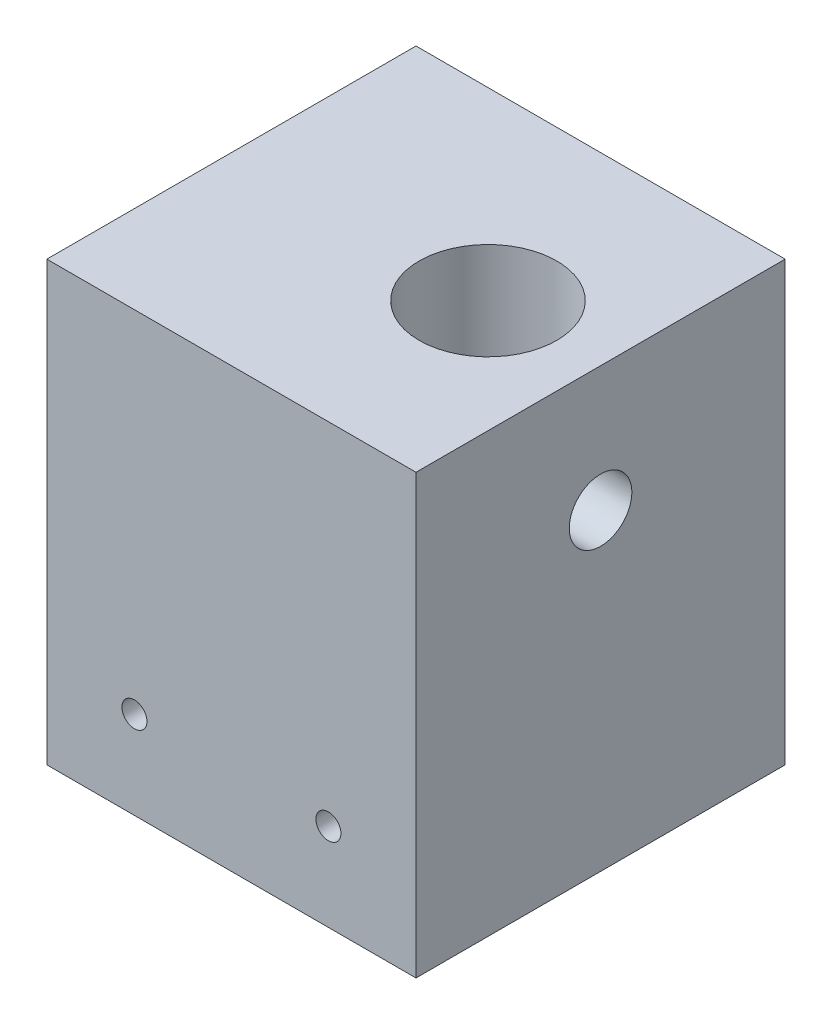
ISO-10303-21;
HEADER;
FILE_DESCRIPTION(('STEP AP214'),'2;1');
FILE_NAME('part.step','',(''),(''),'','','');
FILE_SCHEMA(('AUTOMOTIVE_DESIGN { 1 0 10303 214 1 1 1 1 }'));
ENDSEC;
DATA;
#1=APPLICATION_CONTEXT('core data for automotive mechanical design processes');
#2=APPLICATION_PROTOCOL_DEFINITION('international standard','automotive_design',2000,#1);
#3=PRODUCT_CONTEXT('',#1,'mechanical');
#4=PRODUCT('Part','Part','',(#3));
#5=PRODUCT_RELATED_PRODUCT_CATEGORY('part','',(#4));
#6=PRODUCT_DEFINITION_FORMATION('','',#4);
#7=PRODUCT_DEFINITION_CONTEXT('part definition',#1,'design');
#8=PRODUCT_DEFINITION('design','',#6,#7);
#9=PRODUCT_DEFINITION_SHAPE('','',#8);
#10=(LENGTH_UNIT() NAMED_UNIT(*) SI_UNIT(.MILLI.,.METRE.));
#11=(NAMED_UNIT(*) PLANE_ANGLE_UNIT() SI_UNIT($,.RADIAN.));
#12=(NAMED_UNIT(*) SI_UNIT($,.STERADIAN.) SOLID_ANGLE_UNIT());
#13=UNCERTAINTY_MEASURE_WITH_UNIT(LENGTH_MEASURE(1.E-05),#10,'distance_accuracy_value','');
#14=(GEOMETRIC_REPRESENTATION_CONTEXT(3) GLOBAL_UNCERTAINTY_ASSIGNED_CONTEXT((#13)) GLOBAL_UNIT_ASSIGNED_CONTEXT((#10,
#11,#12)) REPRESENTATION_CONTEXT('',''));
#15=CARTESIAN_POINT('',(0.,0.,0.));
#16=DIRECTION('',(0.,0.,1.));
#17=DIRECTION('',(1.,0.,0.));
#18=AXIS2_PLACEMENT_3D('',#15,#16,#17);
#19=CARTESIAN_POINT('',(-29.2910308500217,70.,-17.4414774606947));
#20=DIRECTION('',(1.,0.,0.));
#21=DIRECTION('',(0.,0.,-1.));
#22=AXIS2_PLACEMENT_3D('',#19,#20,#21);
#23=PLANE('',#22);
#24=DIRECTION('',(0.,0.,1.));
#25=VECTOR('',#24,1.);
#26=CARTESIAN_POINT('',(-29.2910308500217,0.,-17.4414774606947));
#27=LINE('',#26,#25);
#28=CARTESIAN_POINT('',(-29.2910308500217,0.,-17.4414774606947));
#29=VERTEX_POINT('',#28);
#30=CARTESIAN_POINT('',(-29.2910308500217,0.,41.5585225393053));
#31=VERTEX_POINT('',#30);
#32=EDGE_CURVE('E101',#29,#31,#27,.T.);
#33=ORIENTED_EDGE('',*,*,#32,.T.);
#34=DIRECTION('',(0.,-1.,0.));
#35=VECTOR('',#34,1.);
#36=CARTESIAN_POINT('',(-29.2910308500217,70.,41.5585225393053));
#37=LINE('',#36,#35);
#38=CARTESIAN_POINT('',(-29.2910308500217,70.,41.5585225393053));
#39=VERTEX_POINT('',#38);
#40=EDGE_CURVE('E11',#39,#31,#37,.T.);
#41=ORIENTED_EDGE('',*,*,#40,.F.);
#42=DIRECTION('',(0.,0.,1.));
#43=VECTOR('',#42,1.);
#44=CARTESIAN_POINT('',(-29.2910308500217,70.,-17.4414774606947));
#45=LINE('',#44,#43);
#46=CARTESIAN_POINT('',(-29.2910308500217,70.,-17.4414774606947));
#47=VERTEX_POINT('',#46);
#48=EDGE_CURVE('E86',#47,#39,#45,.T.);
#49=ORIENTED_EDGE('',*,*,#48,.F.);
#50=DIRECTION('',(0.,-1.,0.));
#51=VECTOR('',#50,1.);
#52=CARTESIAN_POINT('',(-29.2910308500217,70.,-17.4414774606947));
#53=LINE('',#52,#51);
#54=EDGE_CURVE('E97',#47,#29,#53,.T.);
#55=ORIENTED_EDGE('',*,*,#54,.T.);
#56=EDGE_LOOP('',(#33,#41,#49,#55));
#57=FACE_BOUND('',#56,.T.);
#58=ADVANCED_FACE('F33',(#57),#23,.F.);
#59=CARTESIAN_POINT('',(-29.2910308500217,70.,41.5585225393053));
#60=DIRECTION('',(0.,0.,-1.));
#61=DIRECTION('',(-1.,0.,0.));
#62=AXIS2_PLACEMENT_3D('',#59,#60,#61);
#63=PLANE('',#62);
#64=CARTESIAN_POINT('',(15.7089691499783,14.,41.5585225393053));
#65=DIRECTION('',(0.,0.,1.));
#66=DIRECTION('',(1.,0.,0.));
#67=AXIS2_PLACEMENT_3D('',#64,#65,#66);
#68=CIRCLE('',#67,2.);
#69=CARTESIAN_POINT('',(17.7089691499783,14.,41.5585225393053));
#70=VERTEX_POINT('',#69);
#71=EDGE_CURVE('E124',#70,#70,#68,.T.);
#72=ORIENTED_EDGE('',*,*,#71,.F.);
#73=EDGE_LOOP('',(#72));
#74=FACE_BOUND('',#73,.T.);
#75=CARTESIAN_POINT('',(-15.2910308500216,14.,41.5585225393053));
#76=DIRECTION('',(0.,0.,1.));
#77=DIRECTION('',(1.,0.,0.));
#78=AXIS2_PLACEMENT_3D('',#75,#76,#77);
#79=CIRCLE('',#78,2.);
#80=CARTESIAN_POINT('',(-13.2910308500216,14.,41.5585225393053));
#81=VERTEX_POINT('',#80);
#82=EDGE_CURVE('E118',#81,#81,#79,.T.);
#83=ORIENTED_EDGE('',*,*,#82,.F.);
#84=EDGE_LOOP('',(#83));
#85=FACE_BOUND('',#84,.T.);
#86=DIRECTION('',(1.,0.,0.));
#87=VECTOR('',#86,1.);
#88=CARTESIAN_POINT('',(-29.2910308500217,0.,41.5585225393053));
#89=LINE('',#88,#87);
#90=CARTESIAN_POINT('',(29.7089691499783,0.,41.5585225393053));
#91=VERTEX_POINT('',#90);
#92=EDGE_CURVE('E91',#31,#91,#89,.T.);
#93=ORIENTED_EDGE('',*,*,#92,.T.);
#94=DIRECTION('',(0.,-1.,0.));
#95=VECTOR('',#94,1.);
#96=CARTESIAN_POINT('',(29.7089691499783,70.,41.5585225393053));
#97=LINE('',#96,#95);
#98=CARTESIAN_POINT('',(29.7089691499783,70.,41.5585225393053));
#99=VERTEX_POINT('',#98);
#100=EDGE_CURVE('E40',#99,#91,#97,.T.);
#101=ORIENTED_EDGE('',*,*,#100,.F.);
#102=DIRECTION('',(1.,0.,0.));
#103=VECTOR('',#102,1.);
#104=CARTESIAN_POINT('',(-29.2910308500217,70.,41.5585225393053));
#105=LINE('',#104,#103);
#106=EDGE_CURVE('E80',#39,#99,#105,.T.);
#107=ORIENTED_EDGE('',*,*,#106,.F.);
#108=ORIENTED_EDGE('',*,*,#40,.T.);
#109=EDGE_LOOP('',(#93,#101,#107,#108));
#110=FACE_BOUND('',#109,.T.);
#111=ADVANCED_FACE('F90',(#74,#85,#110),#63,.F.);
#112=CARTESIAN_POINT('',(29.7089691499783,70.,-17.4414774606947));
#113=DIRECTION('',(-1.,0.,0.));
#114=DIRECTION('',(0.,0.,1.));
#115=AXIS2_PLACEMENT_3D('',#112,#113,#114);
#116=PLANE('',#115);
#117=CARTESIAN_POINT('',(29.7089691499783,50.,12.0585225393053));
#118=DIRECTION('',(1.,0.,0.));
#119=DIRECTION('',(0.,0.,-1.));
#120=AXIS2_PLACEMENT_3D('',#117,#118,#119);
#121=CIRCLE('',#120,5.);
#122=CARTESIAN_POINT('',(29.7089691499783,50.,7.05852253930527));
#123=VERTEX_POINT('',#122);
#124=EDGE_CURVE('E131',#123,#123,#121,.T.);
#125=ORIENTED_EDGE('',*,*,#124,.F.);
#126=EDGE_LOOP('',(#125));
#127=FACE_BOUND('',#126,.T.);
#128=DIRECTION('',(0.,0.,-1.));
#129=VECTOR('',#128,1.);
#130=CARTESIAN_POINT('',(29.7089691499783,0.,-17.4414774606947));
#131=LINE('',#130,#129);
#132=CARTESIAN_POINT('',(29.7089691499783,0.,-17.4414774606947));
#133=VERTEX_POINT('',#132);
#134=EDGE_CURVE('E106',#91,#133,#131,.T.);
#135=ORIENTED_EDGE('',*,*,#134,.T.);
#136=DIRECTION('',(0.,-1.,0.));
#137=VECTOR('',#136,1.);
#138=CARTESIAN_POINT('',(29.7089691499783,70.,-17.4414774606947));
#139=LINE('',#138,#137);
#140=CARTESIAN_POINT('',(29.7089691499783,70.,-17.4414774606947));
#141=VERTEX_POINT('',#140);
#142=EDGE_CURVE('E94',#141,#133,#139,.T.);
#143=ORIENTED_EDGE('',*,*,#142,.F.);
#144=DIRECTION('',(0.,0.,-1.));
#145=VECTOR('',#144,1.);
#146=CARTESIAN_POINT('',(29.7089691499783,70.,-17.4414774606947));
#147=LINE('',#146,#145);
#148=EDGE_CURVE('E83',#99,#141,#147,.T.);
#149=ORIENTED_EDGE('',*,*,#148,.F.);
#150=ORIENTED_EDGE('',*,*,#100,.T.);
#151=EDGE_LOOP('',(#135,#143,#149,#150));
#152=FACE_BOUND('',#151,.T.);
#153=ADVANCED_FACE('F95',(#127,#152),#116,.F.);
#154=CARTESIAN_POINT('',(-29.2910308500217,70.,-17.4414774606947));
#155=DIRECTION('',(0.,0.,1.));
#156=DIRECTION('',(1.,0.,0.));
#157=AXIS2_PLACEMENT_3D('',#154,#155,#156);
#158=PLANE('',#157);
#159=CARTESIAN_POINT('',(15.7089691499783,14.,-17.4414774606947));
#160=DIRECTION('',(0.,0.,1.));
#161=DIRECTION('',(1.,0.,0.));
#162=AXIS2_PLACEMENT_3D('',#159,#160,#161);
#163=CIRCLE('',#162,2.);
#164=CARTESIAN_POINT('',(17.7089691499783,14.,-17.4414774606947));
#165=VERTEX_POINT('',#164);
#166=EDGE_CURVE('E121',#165,#165,#163,.F.);
#167=ORIENTED_EDGE('',*,*,#166,.F.);
#168=EDGE_LOOP('',(#167));
#169=FACE_BOUND('',#168,.T.);
#170=CARTESIAN_POINT('',(-15.2910308500216,14.,-17.4414774606947));
#171=DIRECTION('',(0.,0.,1.));
#172=DIRECTION('',(1.,0.,0.));
#173=AXIS2_PLACEMENT_3D('',#170,#171,#172);
#174=CIRCLE('',#173,2.);
#175=CARTESIAN_POINT('',(-13.2910308500216,14.,-17.4414774606947));
#176=VERTEX_POINT('',#175);
#177=EDGE_CURVE('E104',#176,#176,#174,.F.);
#178=ORIENTED_EDGE('',*,*,#177,.F.);
#179=EDGE_LOOP('',(#178));
#180=FACE_BOUND('',#179,.T.);
#181=DIRECTION('',(-1.,0.,0.));
#182=VECTOR('',#181,1.);
#183=CARTESIAN_POINT('',(-29.2910308500217,0.,-17.4414774606947));
#184=LINE('',#183,#182);
#185=EDGE_CURVE('E73',#133,#29,#184,.T.);
#186=ORIENTED_EDGE('',*,*,#185,.T.);
#187=ORIENTED_EDGE('',*,*,#54,.F.);
#188=DIRECTION('',(-1.,0.,0.));
#189=VECTOR('',#188,1.);
#190=CARTESIAN_POINT('',(-29.2910308500217,70.,-17.4414774606947));
#191=LINE('',#190,#189);
#192=EDGE_CURVE('E53',#141,#47,#191,.T.);
#193=ORIENTED_EDGE('',*,*,#192,.F.);
#194=ORIENTED_EDGE('',*,*,#142,.T.);
#195=EDGE_LOOP('',(#186,#187,#193,#194));
#196=FACE_BOUND('',#195,.T.);
#197=ADVANCED_FACE('F110',(#169,#180,#196),#158,.F.);
#198=CARTESIAN_POINT('',(0.,70.,0.));
#199=DIRECTION('',(0.,1.,0.));
#200=DIRECTION('',(0.,0.,1.));
#201=AXIS2_PLACEMENT_3D('',#198,#199,#200);
#202=PLANE('',#201);
#203=CARTESIAN_POINT('',(11.7089691499783,70.,12.0585225393053));
#204=DIRECTION('',(0.,1.,0.));
#205=DIRECTION('',(0.,0.,1.));
#206=AXIS2_PLACEMENT_3D('',#203,#204,#205);
#207=CIRCLE('',#206,11.);
#208=CARTESIAN_POINT('',(11.7089691499783,70.,23.0585225393053));
#209=VERTEX_POINT('',#208);
#210=EDGE_CURVE('E128',#209,#209,#207,.T.);
#211=ORIENTED_EDGE('',*,*,#210,.F.);
#212=EDGE_LOOP('',(#211));
#213=FACE_BOUND('',#212,.T.);
#214=ORIENTED_EDGE('',*,*,#48,.T.);
#215=ORIENTED_EDGE('',*,*,#106,.T.);
#216=ORIENTED_EDGE('',*,*,#148,.T.);
#217=ORIENTED_EDGE('',*,*,#192,.T.);
#218=EDGE_LOOP('',(#214,#215,#216,#217));
#219=FACE_BOUND('',#218,.T.);
#220=ADVANCED_FACE('F81',(#213,#219),#202,.T.);
#221=CARTESIAN_POINT('',(0.,0.,0.));
#222=DIRECTION('',(0.,1.,0.));
#223=DIRECTION('',(0.,0.,1.));
#224=AXIS2_PLACEMENT_3D('',#221,#222,#223);
#225=PLANE('',#224);
#226=ORIENTED_EDGE('',*,*,#32,.F.);
#227=ORIENTED_EDGE('',*,*,#185,.F.);
#228=ORIENTED_EDGE('',*,*,#134,.F.);
#229=ORIENTED_EDGE('',*,*,#92,.F.);
#230=EDGE_LOOP('',(#226,#227,#228,#229));
#231=FACE_BOUND('',#230,.T.);
#232=ADVANCED_FACE('F113',(#231),#225,.F.);
#233=CARTESIAN_POINT('',(-15.2910308500216,14.,-17.4424774606947));
#234=DIRECTION('',(0.,0.,1.));
#235=DIRECTION('',(1.,0.,0.));
#236=AXIS2_PLACEMENT_3D('',#233,#234,#235);
#237=CYLINDRICAL_SURFACE('',#236,2.);
#238=ORIENTED_EDGE('',*,*,#82,.T.);
#239=EDGE_LOOP('',(#238));
#240=FACE_BOUND('',#239,.T.);
#241=ORIENTED_EDGE('',*,*,#177,.T.);
#242=EDGE_LOOP('',(#241));
#243=FACE_BOUND('',#242,.T.);
#244=ADVANCED_FACE('F157',(#240,#243),#237,.F.);
#245=CARTESIAN_POINT('',(15.7089691499783,14.,-17.4424774606947));
#246=DIRECTION('',(0.,0.,1.));
#247=DIRECTION('',(1.,0.,0.));
#248=AXIS2_PLACEMENT_3D('',#245,#246,#247);
#249=CYLINDRICAL_SURFACE('',#248,2.);
#250=ORIENTED_EDGE('',*,*,#71,.T.);
#251=EDGE_LOOP('',(#250));
#252=FACE_BOUND('',#251,.T.);
#253=ORIENTED_EDGE('',*,*,#166,.T.);
#254=EDGE_LOOP('',(#253));
#255=FACE_BOUND('',#254,.T.);
#256=ADVANCED_FACE('F153',(#252,#255),#249,.F.);
#257=CARTESIAN_POINT('',(11.7089691499783,45.,12.0585225393053));
#258=DIRECTION('',(0.,1.,0.));
#259=DIRECTION('',(0.,0.,1.));
#260=AXIS2_PLACEMENT_3D('',#257,#258,#259);
#261=CYLINDRICAL_SURFACE('',#260,11.);
#262=CARTESIAN_POINT('',(11.7089691499783,45.,12.0585225393053));
#263=DIRECTION('',(0.,1.,0.));
#264=DIRECTION('',(0.,0.,1.));
#265=AXIS2_PLACEMENT_3D('',#262,#263,#264);
#266=CIRCLE('',#265,11.);
#267=CARTESIAN_POINT('',(22.7089691499783,45.,12.0585225393053));
#268=VERTEX_POINT('',#267);
#269=EDGE_CURVE('E127',#268,#268,#266,.T.);
#270=ORIENTED_EDGE('',*,*,#269,.F.);
#271=CARTESIAN_POINT('',(21.5069281211111,50.,7.05852253930527));
#272=CARTESIAN_POINT('',(21.5069293280527,49.8679173210699,7.05852358534839));
#273=CARTESIAN_POINT('',(21.5096082249125,49.7358026679107,7.06376370524182));
#274=CARTESIAN_POINT('',(21.5202318962564,49.4725578587148,7.08466527289141));
#275=CARTESIAN_POINT('',(21.528179688191,49.341428310384,7.10033269229194));
#276=CARTESIAN_POINT('',(21.5490787390548,49.080957058461,7.1419398760196));
#277=CARTESIAN_POINT('',(21.5620394912622,48.9516192322237,7.16789913283113));
#278=CARTESIAN_POINT('',(21.5925238577832,48.6958569461342,7.22980277477237));
#279=CARTESIAN_POINT('',(21.6100494161234,48.5694337525744,7.26575141454511));
#280=CARTESIAN_POINT('',(21.6489938669881,48.3209927471774,7.34705497100975));
#281=CARTESIAN_POINT('',(21.6703925587851,48.1989558412882,7.3923612473474));
#282=CARTESIAN_POINT('',(21.7164981889132,47.9592917103172,7.49208191514752));
#283=CARTESIAN_POINT('',(21.741206379139,47.8416661755969,7.54649975522787));
#284=CARTESIAN_POINT('',(21.8192362379378,47.4964750042423,7.72274128849976));
#285=CARTESIAN_POINT('',(21.8765093001181,47.2763169195181,7.85764478994638));
#286=CARTESIAN_POINT('',(21.999798282919,46.8461772171732,8.16895880598199));
#287=CARTESIAN_POINT('',(22.0661434511006,46.6378877844904,8.34755766083746));
#288=CARTESIAN_POINT('',(22.1974618835479,46.2528341842249,8.73683743589441));
#289=CARTESIAN_POINT('',(22.2624345463262,46.0760835955238,8.94753210275637));
#290=CARTESIAN_POINT('',(22.3556140891339,45.8338288574682,9.2901201210345));
#291=CARTESIAN_POINT('',(22.3866823782892,45.7552324689297,9.41218441184158));
#292=CARTESIAN_POINT('',(22.4457809475878,45.6086872812711,9.66322224823257));
#293=CARTESIAN_POINT('',(22.4738125090081,45.5407339861068,9.792192845267));
#294=CARTESIAN_POINT('',(22.5260351867077,45.4161021230378,10.0562240169791));
#295=CARTESIAN_POINT('',(22.5502261148675,45.3594241073775,10.1912848895512));
#296=CARTESIAN_POINT('',(22.5940376541186,45.257973994221,10.4664565554701));
#297=CARTESIAN_POINT('',(22.6136606679392,45.2131956357253,10.6065646489807));
#298=CARTESIAN_POINT('',(22.6467208168966,45.1383677661874,10.8822206861574));
#299=CARTESIAN_POINT('',(22.6604589521726,45.1075945291213,11.0175362783581));
#300=CARTESIAN_POINT('',(22.682986259509,45.0573735271231,11.2906012093711));
#301=CARTESIAN_POINT('',(22.6917777278464,45.037920507124,11.4283493882802));
#302=CARTESIAN_POINT('',(22.7041659966365,45.0105608934896,11.7051929867573));
#303=CARTESIAN_POINT('',(22.70776383737,45.002651987571,11.8442881309083));
#304=CARTESIAN_POINT('',(22.7096626109521,44.9984741363374,12.1226862635707));
#305=CARTESIAN_POINT('',(22.7079637977118,45.0022046330527,12.2619892417991));
#306=CARTESIAN_POINT('',(22.6996343189569,45.0205643031978,12.5295641266342));
#307=CARTESIAN_POINT('',(22.6933699402222,45.0343841601721,12.6579039319014));
#308=CARTESIAN_POINT('',(22.6764842165653,45.0718496314977,12.9128915440009));
#309=CARTESIAN_POINT('',(22.6658614471496,45.0954984583756,13.0395387836487));
#310=CARTESIAN_POINT('',(22.6405206421017,45.152375029347,13.2902034038339));
#311=CARTESIAN_POINT('',(22.6258039752329,45.1855995720065,13.4142216484668));
#312=CARTESIAN_POINT('',(22.5926297124611,45.261306733177,13.6589020619532));
#313=CARTESIAN_POINT('',(22.5741706892561,45.303792884451,13.779562930305));
#314=CARTESIAN_POINT('',(22.5132015016936,45.4459986464636,14.1388959778144));
#315=CARTESIAN_POINT('',(22.4654765454577,45.5596499767068,14.3713471622879));
#316=CARTESIAN_POINT('',(22.3606059238175,45.8201042765048,14.8143627674766));
#317=CARTESIAN_POINT('',(22.3034568099564,45.9669193885417,15.0249191303522));
#318=CARTESIAN_POINT('',(22.1798093954521,46.3033849638686,15.4365911009568));
#319=CARTESIAN_POINT('',(22.1129287336833,46.4955519799619,15.6355372037354));
#320=CARTESIAN_POINT('',(21.9805991341564,46.9105111236905,15.9994860710281));
#321=CARTESIAN_POINT('',(21.9151509906035,47.1333197646374,16.1644704124301));
#322=CARTESIAN_POINT('',(21.8220923937575,47.4921216524752,16.3865235253923));
#323=CARTESIAN_POINT('',(21.7913190936561,47.6188591439386,16.4575406021443));
#324=CARTESIAN_POINT('',(21.7331480881747,47.8786411399072,16.5885299735649));
#325=CARTESIAN_POINT('',(21.7057489774715,48.0116829865088,16.6485068715642));
#326=CARTESIAN_POINT('',(21.6553141467485,48.2831547011219,16.756798121509));
#327=CARTESIAN_POINT('',(21.6322763317767,48.4215819435346,16.8051180759522));
#328=CARTESIAN_POINT('',(21.5914396006044,48.7028611321448,16.8895661886511));
#329=CARTESIAN_POINT('',(21.5736401084945,48.8457125900271,16.9256956872086));
#330=CARTESIAN_POINT('',(21.545093791552,49.1241505787865,16.9831142304419));
#331=CARTESIAN_POINT('',(21.5339287717928,49.2595116434057,17.0052902366724));
#332=CARTESIAN_POINT('',(21.5171601022788,49.5319349031965,17.0384561344657));
#333=CARTESIAN_POINT('',(21.5115559604694,49.6689969467701,17.0494470157471));
#334=CARTESIAN_POINT('',(21.5061288682566,49.9436221102819,17.0600920462336));
#335=CARTESIAN_POINT('',(21.5063036801157,50.081185015644,17.0597505835705));
#336=CARTESIAN_POINT('',(21.5124216369931,50.3556807359476,17.0477473533969));
#337=CARTESIAN_POINT('',(21.5183645309616,50.4926135780513,17.0360860785696));
#338=CARTESIAN_POINT('',(21.5350647799976,50.7534335361661,17.0030301484236));
#339=CARTESIAN_POINT('',(21.5453827192696,50.8774619906973,16.9825214350216));
#340=CARTESIAN_POINT('',(21.5703405126454,51.1232207035374,16.9323432362687));
#341=CARTESIAN_POINT('',(21.5849817319668,51.2449502229433,16.9026708570535));
#342=CARTESIAN_POINT('',(21.634751877344,51.6054971593774,16.8003235721328));
#343=CARTESIAN_POINT('',(21.6757402801146,51.839859791701,16.7142943880432));
#344=CARTESIAN_POINT('',(21.7709456196197,52.3014987360579,16.5049090756067));
#345=CARTESIAN_POINT('',(21.8256785760124,52.5279704854606,16.3800358478335));
#346=CARTESIAN_POINT('',(21.9416026090885,52.9579894020815,16.0978850291328));
#347=CARTESIAN_POINT('',(22.0027967914891,53.1615254467339,15.9405918199923));
#348=CARTESIAN_POINT('',(22.1321313729451,53.5611232228233,15.5796054860876));
#349=CARTESIAN_POINT('',(22.2003530730513,53.7543896344801,15.3728414317373));
#350=CARTESIAN_POINT('',(22.3305594060097,54.1042157566132,14.9282412646211));
#351=CARTESIAN_POINT('',(22.3925429721193,54.2607691951112,14.6903998534472));
#352=CARTESIAN_POINT('',(22.4761715632307,54.465033262432,14.3133635579673));
#353=CARTESIAN_POINT('',(22.502621973497,54.5283171404165,14.1834506591068));
#354=CARTESIAN_POINT('',(22.5514998532177,54.6436203644133,13.9180093622417));
#355=CARTESIAN_POINT('',(22.5739290667362,54.6956445959714,13.7824834302584));
#356=CARTESIAN_POINT('',(22.6140948547672,54.7878477952021,13.5068434882259));
#357=CARTESIAN_POINT('',(22.6318331343504,54.8280310674604,13.3667311661152));
#358=CARTESIAN_POINT('',(22.6620872154888,54.8960930908442,13.0829967789546));
#359=CARTESIAN_POINT('',(22.6746035049602,54.9239729915484,12.9393750431345));
#360=CARTESIAN_POINT('',(22.6932404988476,54.9653325109347,12.6615076586751));
#361=CARTESIAN_POINT('',(22.6997941954625,54.9797890008153,12.5274356110763));
#362=CARTESIAN_POINT('',(22.7079758418999,54.9978209253767,12.2584144922636));
#363=CARTESIAN_POINT('',(22.7096040682276,55.0013969708622,12.1234654707074));
#364=CARTESIAN_POINT('',(22.7078900566199,54.9976258060142,11.8537815102018));
#365=CARTESIAN_POINT('',(22.7045488655801,54.990280896373,11.7190465321459));
#366=CARTESIAN_POINT('',(22.6929903413852,54.9647608429357,11.4508217052268));
#367=CARTESIAN_POINT('',(22.684773076179,54.9465858500586,11.317331839039));
#368=CARTESIAN_POINT('',(22.6641918007119,54.9007451424797,11.0589907676515));
#369=CARTESIAN_POINT('',(22.6520467187293,54.8735790246001,10.9340332775817));
#370=CARTESIAN_POINT('',(22.62383624462,54.8098989095211,10.6869639019392));
#371=CARTESIAN_POINT('',(22.6077695832865,54.7733818857422,10.5648529516853));
#372=CARTESIAN_POINT('',(22.554229505632,54.6502918585214,10.2040013534889));
#373=CARTESIAN_POINT('',(22.5113981658849,54.5501417107286,9.97052968190506));
#374=CARTESIAN_POINT('',(22.4130600467329,54.3115973706824,9.51297200125048));
#375=CARTESIAN_POINT('',(22.3570631756473,54.1716636686301,9.28980349176803));
#376=CARTESIAN_POINT('',(22.2387054437516,53.8595564758061,8.86909565082526));
#377=CARTESIAN_POINT('',(22.1763418070851,53.6873688950663,8.67156758437027));
#378=CARTESIAN_POINT('',(22.045675212644,53.2990398538788,8.29071909998991));
#379=CARTESIAN_POINT('',(21.9773074979166,53.0804413954771,8.10992355515062));
#380=CARTESIAN_POINT('',(21.8471992661557,52.6141205873621,7.78690475915852));
#381=CARTESIAN_POINT('',(21.7854631335516,52.3663791939624,7.64470693295209));
#382=CARTESIAN_POINT('',(21.7034807874254,51.9765310205315,7.46350648377464));
#383=CARTESIAN_POINT('',(21.6778312059475,51.8428894607224,7.40827813393262));
#384=CARTESIAN_POINT('',(21.6311138114228,51.570634856846,7.30941314939233));
#385=CARTESIAN_POINT('',(21.6100436881644,51.432024360778,7.26577066746765));
#386=CARTESIAN_POINT('',(21.5733502047848,51.1512361544575,7.19069651956876));
#387=CARTESIAN_POINT('',(21.5577125915805,51.009068844213,7.15923287522792));
#388=CARTESIAN_POINT('',(21.5324619181148,50.7220803478183,7.10879588134806));
#389=CARTESIAN_POINT('',(21.5228443877897,50.5772612131526,7.08981326380188));
#390=CARTESIAN_POINT('',(21.5132784086377,50.3600490514176,7.07098213567825));
#391=CARTESIAN_POINT('',(21.5108998940765,50.2881450927426,7.06631207130119));
#392=CARTESIAN_POINT('',(21.5077243927483,50.1441639347676,7.06008193219416));
#393=CARTESIAN_POINT('',(21.5069274623988,50.0720867293794,7.05852196840659));
#394=CARTESIAN_POINT('',(21.5069281211111,50.,7.05852253930527));
#395=B_SPLINE_CURVE_WITH_KNOTS('',3,(#271,#272,#273,#274,#275,#276,#277,#278,#279,#280,#281,
#282,#283,#284,#285,#286,#287,#288,#289,#290,#291,#292,#293,#294,#295,#296,#297,#298,#299,#300,
#301,#302,#303,#304,#305,#306,#307,#308,#309,#310,#311,#312,#313,#314,#315,#316,#317,#318,#319,
#320,#321,#322,#323,#324,#325,#326,#327,#328,#329,#330,#331,#332,#333,#334,#335,#336,#337,#338,
#339,#340,#341,#342,#343,#344,#345,#346,#347,#348,#349,#350,#351,#352,#353,#354,#355,#356,#357,
#358,#359,#360,#361,#362,#363,#364,#365,#366,#367,#368,#369,#370,#371,#372,#373,#374,#375,#376,
#377,#378,#379,#380,#381,#382,#383,#384,#385,#386,#387,#388,#389,#390,#391,#392,#393,#394),
.UNSPECIFIED.,.T.,.F.,(4,2,2,2,2,2,2,2,2,2,2,2,2,2,2,2,2,2,2,2,2,2,2,2,2,2,2,2,2,2,2,2,2,2,2,2,
2,2,2,2,2,2,2,2,2,2,2,2,2,2,2,2,2,2,2,2,2,2,2,2,2,4),(0.,0.396173449036409,0.792573979403788,
1.18972889685952,1.5870532291044,1.98236205044122,2.37782083105862,3.16785961735518,
4.01126913920716,4.85504091494796,5.29996379443773,5.74469821181001,6.18945440617718,
6.63397612686386,7.05176962155086,7.4693690132577,7.88688474842091,8.30438046901964,
8.69162402822476,9.07899425479608,9.46623512242218,9.85362395910082,10.6393204264571,
11.4253050338565,12.2753745999014,13.1259040918642,13.5709254162501,14.0157607614081,
14.4603818843391,14.9049541066495,15.3172515663195,15.7295125405751,16.1416138802191,
16.5536972843863,16.9316577034691,17.3097376038346,18.0653376230059,18.8552361505469,
19.6455161021152,20.5150293098038,21.384690955526,21.8249215845502,22.2649608134287,
22.7048398753882,23.1446778280696,23.5491834648732,23.9536663931837,24.3580641220897,
24.7624562157796,25.1473595183331,25.5323875591939,26.3018020433608,27.1064030934073,
27.9113564531507,28.7828614043325,29.6549390445075,30.095016693466,30.5348718172927,
30.973564035315,31.4119301256576,31.6281418935643,31.8443613739635),.UNSPECIFIED.);
#396=EDGE_CURVE('E45',#268,#268,#395,.T.);
#397=ORIENTED_EDGE('',*,*,#396,.F.);
#398=EDGE_LOOP('',(#270,#397));
#399=FACE_BOUND('',#398,.T.);
#400=ORIENTED_EDGE('',*,*,#210,.T.);
#401=EDGE_LOOP('',(#400));
#402=FACE_BOUND('',#401,.T.);
#403=ADVANCED_FACE('F149',(#399,#402),#261,.F.);
#404=CARTESIAN_POINT('',(11.7089691499783,45.,12.0585225393053));
#405=DIRECTION('',(0.,1.,0.));
#406=DIRECTION('',(0.,0.,1.));
#407=AXIS2_PLACEMENT_3D('',#404,#405,#406);
#408=PLANE('',#407);
#409=ORIENTED_EDGE('',*,*,#269,.T.);
#410=EDGE_LOOP('',(#409));
#411=FACE_BOUND('',#410,.T.);
#412=ADVANCED_FACE('F145',(#411),#408,.T.);
#413=CARTESIAN_POINT('',(-29.2920308500217,50.,12.0585225393053));
#414=DIRECTION('',(1.,0.,0.));
#415=DIRECTION('',(0.,0.,-1.));
#416=AXIS2_PLACEMENT_3D('',#413,#414,#415);
#417=CYLINDRICAL_SURFACE('',#416,5.);
#418=ORIENTED_EDGE('',*,*,#124,.T.);
#419=EDGE_LOOP('',(#418));
#420=FACE_BOUND('',#419,.T.);
#421=ORIENTED_EDGE('',*,*,#396,.T.);
#422=EDGE_LOOP('',(#421));
#423=FACE_BOUND('',#422,.T.);
#424=ADVANCED_FACE('F140',(#420,#423),#417,.F.);
#425=CLOSED_SHELL('',(#58,#111,#153,#197,#220,#232,#244,#256,#403,#412,#424));
#426=MANIFOLD_SOLID_BREP('B2',#425);
#427=ADVANCED_BREP_SHAPE_REPRESENTATION('',(#18,#426),#14);
#428=SHAPE_DEFINITION_REPRESENTATION(#9,#427);
ENDSEC;
END-ISO-10303-21;
